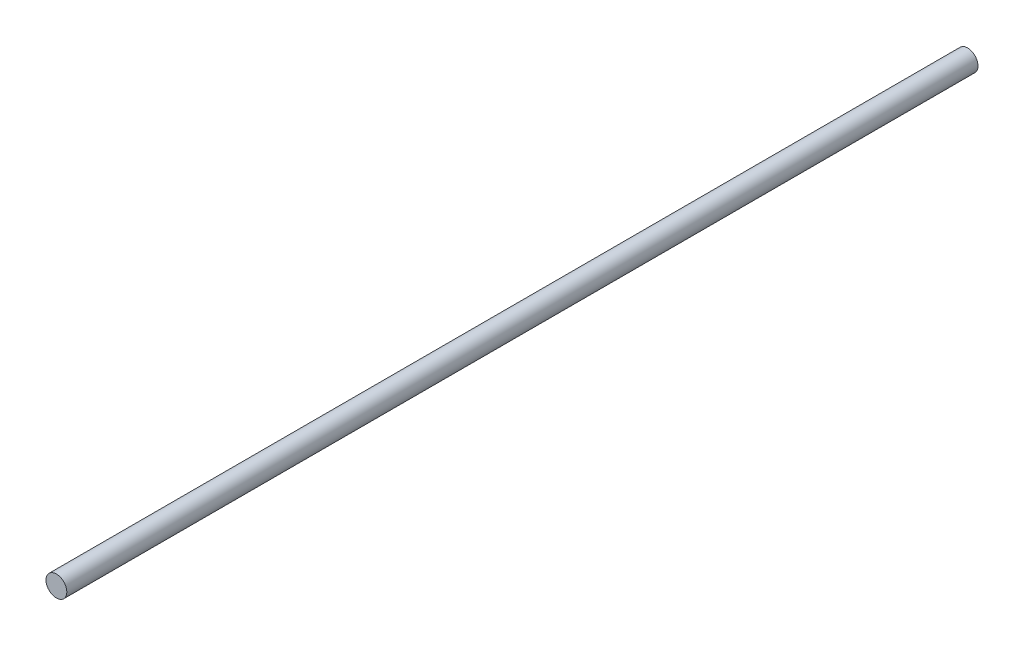
ISO-10303-21;
HEADER;
FILE_DESCRIPTION(('STEP AP214'),'2;1');
FILE_NAME('part.step','',(''),(''),'','','');
FILE_SCHEMA(('AUTOMOTIVE_DESIGN { 1 0 10303 214 1 1 1 1 }'));
ENDSEC;
DATA;
#1=APPLICATION_CONTEXT('core data for automotive mechanical design processes');
#2=APPLICATION_PROTOCOL_DEFINITION('international standard','automotive_design',2000,#1);
#3=PRODUCT_CONTEXT('',#1,'mechanical');
#4=PRODUCT('Part','Part','',(#3));
#5=PRODUCT_RELATED_PRODUCT_CATEGORY('part','',(#4));
#6=PRODUCT_DEFINITION_FORMATION('','',#4);
#7=PRODUCT_DEFINITION_CONTEXT('part definition',#1,'design');
#8=PRODUCT_DEFINITION('design','',#6,#7);
#9=PRODUCT_DEFINITION_SHAPE('','',#8);
#10=(LENGTH_UNIT() NAMED_UNIT(*) SI_UNIT(.MILLI.,.METRE.));
#11=(NAMED_UNIT(*) PLANE_ANGLE_UNIT() SI_UNIT($,.RADIAN.));
#12=(NAMED_UNIT(*) SI_UNIT($,.STERADIAN.) SOLID_ANGLE_UNIT());
#13=UNCERTAINTY_MEASURE_WITH_UNIT(LENGTH_MEASURE(1.E-05),#10,'distance_accuracy_value','');
#14=(GEOMETRIC_REPRESENTATION_CONTEXT(3) GLOBAL_UNCERTAINTY_ASSIGNED_CONTEXT((#13)) GLOBAL_UNIT_ASSIGNED_CONTEXT((#10,
#11,#12)) REPRESENTATION_CONTEXT('',''));
#15=CARTESIAN_POINT('',(0.,0.,0.));
#16=DIRECTION('',(0.,0.,1.));
#17=DIRECTION('',(1.,0.,0.));
#18=AXIS2_PLACEMENT_3D('',#15,#16,#17);
#19=CARTESIAN_POINT('',(0.,0.,350.));
#20=DIRECTION('',(0.,0.,-1.));
#21=DIRECTION('',(-1.,0.,0.));
#22=AXIS2_PLACEMENT_3D('',#19,#20,#21);
#23=CYLINDRICAL_SURFACE('',#22,4.);
#24=CARTESIAN_POINT('',(0.,0.,350.));
#25=DIRECTION('',(0.,0.,1.));
#26=DIRECTION('',(1.,0.,0.));
#27=AXIS2_PLACEMENT_3D('',#24,#25,#26);
#28=CIRCLE('',#27,4.);
#29=CARTESIAN_POINT('',(4.,0.,350.));
#30=VERTEX_POINT('',#29);
#31=EDGE_CURVE('E10',#30,#30,#28,.T.);
#32=ORIENTED_EDGE('',*,*,#31,.F.);
#33=EDGE_LOOP('',(#32));
#34=FACE_BOUND('',#33,.T.);
#35=CARTESIAN_POINT('',(0.,0.,0.));
#36=DIRECTION('',(0.,0.,1.));
#37=DIRECTION('',(1.,0.,0.));
#38=AXIS2_PLACEMENT_3D('',#35,#36,#37);
#39=CIRCLE('',#38,4.);
#40=CARTESIAN_POINT('',(4.,0.,0.));
#41=VERTEX_POINT('',#40);
#42=EDGE_CURVE('E34',#41,#41,#39,.T.);
#43=ORIENTED_EDGE('',*,*,#42,.T.);
#44=EDGE_LOOP('',(#43));
#45=FACE_BOUND('',#44,.T.);
#46=ADVANCED_FACE('F31',(#34,#45),#23,.T.);
#47=CARTESIAN_POINT('',(0.,0.,350.));
#48=DIRECTION('',(0.,0.,1.));
#49=DIRECTION('',(1.,0.,0.));
#50=AXIS2_PLACEMENT_3D('',#47,#48,#49);
#51=PLANE('',#50);
#52=ORIENTED_EDGE('',*,*,#31,.T.);
#53=EDGE_LOOP('',(#52));
#54=FACE_BOUND('',#53,.T.);
#55=ADVANCED_FACE('F46',(#54),#51,.T.);
#56=CARTESIAN_POINT('',(0.,0.,0.));
#57=DIRECTION('',(0.,0.,1.));
#58=DIRECTION('',(1.,0.,0.));
#59=AXIS2_PLACEMENT_3D('',#56,#57,#58);
#60=PLANE('',#59);
#61=ORIENTED_EDGE('',*,*,#42,.F.);
#62=EDGE_LOOP('',(#61));
#63=FACE_BOUND('',#62,.T.);
#64=ADVANCED_FACE('F44',(#63),#60,.F.);
#65=CLOSED_SHELL('',(#46,#55,#64));
#66=MANIFOLD_SOLID_BREP('B2',#65);
#67=ADVANCED_BREP_SHAPE_REPRESENTATION('',(#18,#66),#14);
#68=SHAPE_DEFINITION_REPRESENTATION(#9,#67);
ENDSEC;
END-ISO-10303-21;
